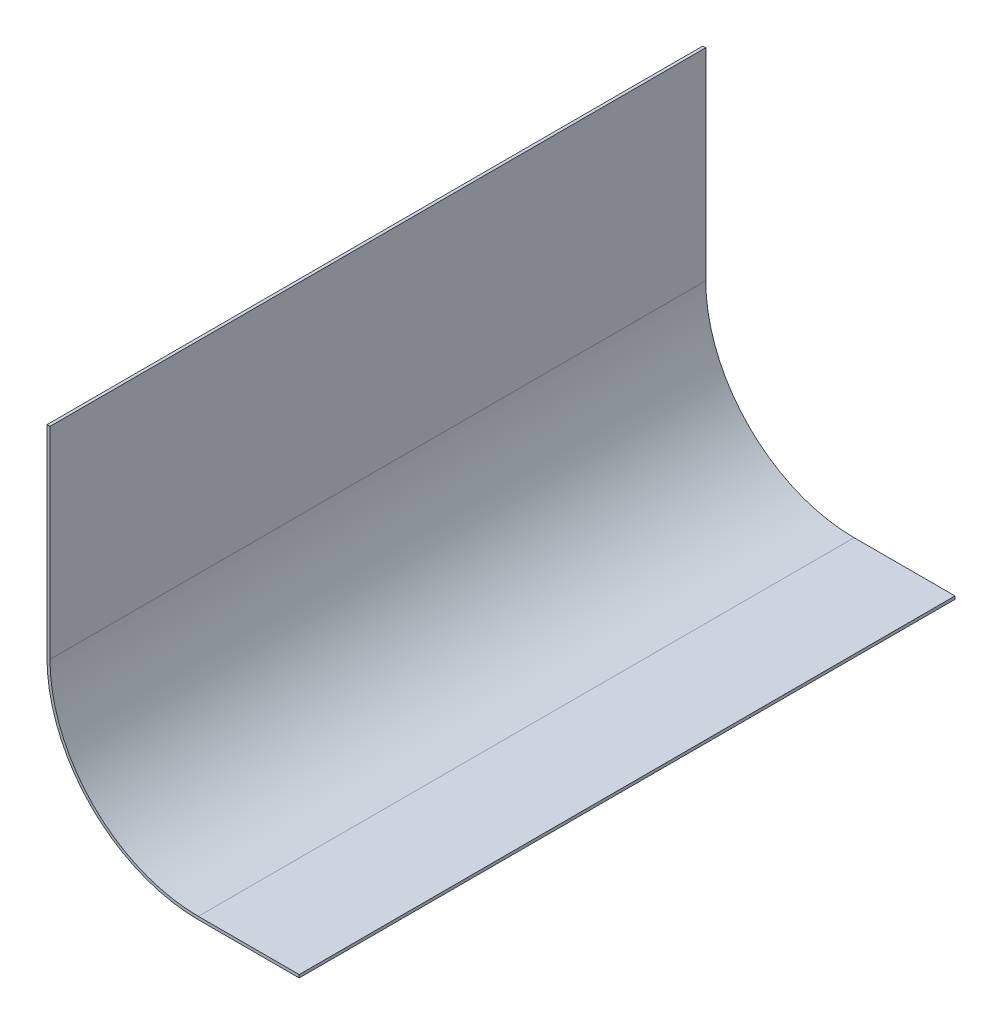
ISO-10303-21;
HEADER;
FILE_DESCRIPTION(('STEP AP214'),'2;1');
FILE_NAME('part.step','',(''),(''),'','','');
FILE_SCHEMA(('AUTOMOTIVE_DESIGN { 1 0 10303 214 1 1 1 1 }'));
ENDSEC;
DATA;
#1=APPLICATION_CONTEXT('core data for automotive mechanical design processes');
#2=APPLICATION_PROTOCOL_DEFINITION('international standard','automotive_design',2000,#1);
#3=PRODUCT_CONTEXT('',#1,'mechanical');
#4=PRODUCT('Part','Part','',(#3));
#5=PRODUCT_RELATED_PRODUCT_CATEGORY('part','',(#4));
#6=PRODUCT_DEFINITION_FORMATION('','',#4);
#7=PRODUCT_DEFINITION_CONTEXT('part definition',#1,'design');
#8=PRODUCT_DEFINITION('design','',#6,#7);
#9=PRODUCT_DEFINITION_SHAPE('','',#8);
#10=(LENGTH_UNIT() NAMED_UNIT(*) SI_UNIT(.MILLI.,.METRE.));
#11=(NAMED_UNIT(*) PLANE_ANGLE_UNIT() SI_UNIT($,.RADIAN.));
#12=(NAMED_UNIT(*) SI_UNIT($,.STERADIAN.) SOLID_ANGLE_UNIT());
#13=UNCERTAINTY_MEASURE_WITH_UNIT(LENGTH_MEASURE(1.E-05),#10,'distance_accuracy_value','');
#14=(GEOMETRIC_REPRESENTATION_CONTEXT(3) GLOBAL_UNCERTAINTY_ASSIGNED_CONTEXT((#13)) GLOBAL_UNIT_ASSIGNED_CONTEXT((#10,
#11,#12)) REPRESENTATION_CONTEXT('',''));
#15=CARTESIAN_POINT('',(0.,0.,0.));
#16=DIRECTION('',(0.,0.,1.));
#17=DIRECTION('',(1.,0.,0.));
#18=AXIS2_PLACEMENT_3D('',#15,#16,#17);
#19=CARTESIAN_POINT('',(-543.675,1066.8,165.1));
#20=DIRECTION('',(-1.,0.,0.));
#21=DIRECTION('',(0.,0.,1.));
#22=AXIS2_PLACEMENT_3D('',#19,#20,#21);
#23=PLANE('',#22);
#24=DIRECTION('',(0.,1.,0.));
#25=VECTOR('',#24,1.);
#26=CARTESIAN_POINT('',(-543.675,1066.8,-165.1));
#27=LINE('',#26,#25);
#28=CARTESIAN_POINT('',(-543.675,1066.8,-165.1));
#29=VERTEX_POINT('',#28);
#30=CARTESIAN_POINT('',(-543.675,1168.4,-165.1));
#31=VERTEX_POINT('',#30);
#32=EDGE_CURVE('E129',#29,#31,#27,.T.);
#33=ORIENTED_EDGE('',*,*,#32,.T.);
#34=DIRECTION('',(0.,0.,-1.));
#35=VECTOR('',#34,1.);
#36=CARTESIAN_POINT('',(-543.675,1168.4,165.1));
#37=LINE('',#36,#35);
#38=CARTESIAN_POINT('',(-543.675,1168.4,165.1));
#39=VERTEX_POINT('',#38);
#40=EDGE_CURVE('E11',#39,#31,#37,.T.);
#41=ORIENTED_EDGE('',*,*,#40,.F.);
#42=DIRECTION('',(0.,1.,0.));
#43=VECTOR('',#42,1.);
#44=CARTESIAN_POINT('',(-543.675,1066.8,165.1));
#45=LINE('',#44,#43);
#46=CARTESIAN_POINT('',(-543.675,1066.8,165.1));
#47=VERTEX_POINT('',#46);
#48=EDGE_CURVE('E87',#47,#39,#45,.T.);
#49=ORIENTED_EDGE('',*,*,#48,.F.);
#50=DIRECTION('',(0.,0.,-1.));
#51=VECTOR('',#50,1.);
#52=CARTESIAN_POINT('',(-543.675,1066.8,165.1));
#53=LINE('',#52,#51);
#54=EDGE_CURVE('E128',#47,#29,#53,.T.);
#55=ORIENTED_EDGE('',*,*,#54,.T.);
#56=EDGE_LOOP('',(#33,#41,#49,#55));
#57=FACE_BOUND('',#56,.T.);
#58=ADVANCED_FACE('F32',(#57),#23,.F.);
#59=CARTESIAN_POINT('',(-545.175,1168.4,165.1));
#60=DIRECTION('',(0.,1.,0.));
#61=DIRECTION('',(0.,0.,1.));
#62=AXIS2_PLACEMENT_3D('',#59,#60,#61);
#63=PLANE('',#62);
#64=DIRECTION('',(1.,0.,0.));
#65=VECTOR('',#64,1.);
#66=CARTESIAN_POINT('',(-545.175,1168.4,-165.1));
#67=LINE('',#66,#65);
#68=CARTESIAN_POINT('',(-545.175,1168.4,-165.1));
#69=VERTEX_POINT('',#68);
#70=EDGE_CURVE('E132',#69,#31,#67,.T.);
#71=ORIENTED_EDGE('',*,*,#70,.F.);
#72=DIRECTION('',(0.,0.,-1.));
#73=VECTOR('',#72,1.);
#74=CARTESIAN_POINT('',(-545.175,1168.4,165.1));
#75=LINE('',#74,#73);
#76=CARTESIAN_POINT('',(-545.175,1168.4,165.1));
#77=VERTEX_POINT('',#76);
#78=EDGE_CURVE('E40',#77,#69,#75,.T.);
#79=ORIENTED_EDGE('',*,*,#78,.F.);
#80=DIRECTION('',(1.,0.,0.));
#81=VECTOR('',#80,1.);
#82=CARTESIAN_POINT('',(-545.175,1168.4,165.1));
#83=LINE('',#82,#81);
#84=EDGE_CURVE('E171',#77,#39,#83,.T.);
#85=ORIENTED_EDGE('',*,*,#84,.T.);
#86=ORIENTED_EDGE('',*,*,#40,.T.);
#87=EDGE_LOOP('',(#71,#79,#85,#86));
#88=FACE_BOUND('',#87,.T.);
#89=ADVANCED_FACE('F162',(#88),#63,.T.);
#90=CARTESIAN_POINT('',(-545.175,1066.8,165.1));
#91=DIRECTION('',(-1.,0.,0.));
#92=DIRECTION('',(0.,0.,1.));
#93=AXIS2_PLACEMENT_3D('',#90,#91,#92);
#94=PLANE('',#93);
#95=DIRECTION('',(0.,1.,0.));
#96=VECTOR('',#95,1.);
#97=CARTESIAN_POINT('',(-545.175,1066.8,-165.1));
#98=LINE('',#97,#96);
#99=CARTESIAN_POINT('',(-545.175,1066.8,-165.1));
#100=VERTEX_POINT('',#99);
#101=EDGE_CURVE('E135',#100,#69,#98,.T.);
#102=ORIENTED_EDGE('',*,*,#101,.F.);
#103=DIRECTION('',(0.,0.,-1.));
#104=VECTOR('',#103,1.);
#105=CARTESIAN_POINT('',(-545.175,1066.8,165.1));
#106=LINE('',#105,#104);
#107=CARTESIAN_POINT('',(-545.175,1066.8,165.1));
#108=VERTEX_POINT('',#107);
#109=EDGE_CURVE('E152',#108,#100,#106,.T.);
#110=ORIENTED_EDGE('',*,*,#109,.F.);
#111=DIRECTION('',(0.,1.,0.));
#112=VECTOR('',#111,1.);
#113=CARTESIAN_POINT('',(-545.175,1066.8,165.1));
#114=LINE('',#113,#112);
#115=EDGE_CURVE('E159',#108,#77,#114,.T.);
#116=ORIENTED_EDGE('',*,*,#115,.T.);
#117=ORIENTED_EDGE('',*,*,#78,.T.);
#118=EDGE_LOOP('',(#102,#110,#116,#117));
#119=FACE_BOUND('',#118,.T.);
#120=ADVANCED_FACE('F157',(#119),#94,.T.);
#121=CARTESIAN_POINT('',(-468.975,1066.8,165.1));
#122=DIRECTION('',(0.,0.,-1.));
#123=DIRECTION('',(-1.,0.,0.));
#124=AXIS2_PLACEMENT_3D('',#121,#122,#123);
#125=CYLINDRICAL_SURFACE('',#124,76.2);
#126=CARTESIAN_POINT('',(-468.975,1066.8,-165.1));
#127=DIRECTION('',(0.,0.,-1.));
#128=DIRECTION('',(-1.,0.,0.));
#129=AXIS2_PLACEMENT_3D('',#126,#127,#128);
#130=CIRCLE('',#129,76.2);
#131=CARTESIAN_POINT('',(-468.975,990.6,-165.1));
#132=VERTEX_POINT('',#131);
#133=EDGE_CURVE('E138',#132,#100,#130,.T.);
#134=ORIENTED_EDGE('',*,*,#133,.F.);
#135=DIRECTION('',(0.,0.,-1.));
#136=VECTOR('',#135,1.);
#137=CARTESIAN_POINT('',(-468.975,990.6,165.1));
#138=LINE('',#137,#136);
#139=CARTESIAN_POINT('',(-468.975,990.6,165.1));
#140=VERTEX_POINT('',#139);
#141=EDGE_CURVE('E150',#140,#132,#138,.T.);
#142=ORIENTED_EDGE('',*,*,#141,.F.);
#143=CARTESIAN_POINT('',(-468.975,1066.8,165.1));
#144=DIRECTION('',(0.,0.,-1.));
#145=DIRECTION('',(-1.,0.,0.));
#146=AXIS2_PLACEMENT_3D('',#143,#144,#145);
#147=CIRCLE('',#146,76.2);
#148=EDGE_CURVE('E123',#140,#108,#147,.T.);
#149=ORIENTED_EDGE('',*,*,#148,.T.);
#150=ORIENTED_EDGE('',*,*,#109,.T.);
#151=EDGE_LOOP('',(#134,#142,#149,#150));
#152=FACE_BOUND('',#151,.T.);
#153=ADVANCED_FACE('F169',(#152),#125,.T.);
#154=CARTESIAN_POINT('',(-418.175,990.6,165.1));
#155=DIRECTION('',(0.,-1.,0.));
#156=DIRECTION('',(1.,0.,0.));
#157=AXIS2_PLACEMENT_3D('',#154,#155,#156);
#158=PLANE('',#157);
#159=DIRECTION('',(-1.,0.,0.));
#160=VECTOR('',#159,1.);
#161=CARTESIAN_POINT('',(-418.175,990.6,-165.1));
#162=LINE('',#161,#160);
#163=CARTESIAN_POINT('',(-418.175,990.6,-165.1));
#164=VERTEX_POINT('',#163);
#165=EDGE_CURVE('E141',#164,#132,#162,.T.);
#166=ORIENTED_EDGE('',*,*,#165,.F.);
#167=DIRECTION('',(0.,0.,-1.));
#168=VECTOR('',#167,1.);
#169=CARTESIAN_POINT('',(-418.175,990.6,165.1));
#170=LINE('',#169,#168);
#171=CARTESIAN_POINT('',(-418.175,990.6,165.1));
#172=VERTEX_POINT('',#171);
#173=EDGE_CURVE('E111',#172,#164,#170,.T.);
#174=ORIENTED_EDGE('',*,*,#173,.F.);
#175=DIRECTION('',(-1.,0.,0.));
#176=VECTOR('',#175,1.);
#177=CARTESIAN_POINT('',(-418.175,990.6,165.1));
#178=LINE('',#177,#176);
#179=EDGE_CURVE('E121',#172,#140,#178,.T.);
#180=ORIENTED_EDGE('',*,*,#179,.T.);
#181=ORIENTED_EDGE('',*,*,#141,.T.);
#182=EDGE_LOOP('',(#166,#174,#180,#181));
#183=FACE_BOUND('',#182,.T.);
#184=ADVANCED_FACE('F176',(#183),#158,.T.);
#185=CARTESIAN_POINT('',(-418.175,992.1,165.1));
#186=DIRECTION('',(1.,0.,0.));
#187=DIRECTION('',(0.,0.,-1.));
#188=AXIS2_PLACEMENT_3D('',#185,#186,#187);
#189=PLANE('',#188);
#190=DIRECTION('',(0.,-1.,0.));
#191=VECTOR('',#190,1.);
#192=CARTESIAN_POINT('',(-418.175,992.1,-165.1));
#193=LINE('',#192,#191);
#194=CARTESIAN_POINT('',(-418.175,992.1,-165.1));
#195=VERTEX_POINT('',#194);
#196=EDGE_CURVE('E110',#195,#164,#193,.T.);
#197=ORIENTED_EDGE('',*,*,#196,.F.);
#198=DIRECTION('',(0.,0.,-1.));
#199=VECTOR('',#198,1.);
#200=CARTESIAN_POINT('',(-418.175,992.1,165.1));
#201=LINE('',#200,#199);
#202=CARTESIAN_POINT('',(-418.175,992.1,165.1));
#203=VERTEX_POINT('',#202);
#204=EDGE_CURVE('E104',#203,#195,#201,.T.);
#205=ORIENTED_EDGE('',*,*,#204,.F.);
#206=DIRECTION('',(0.,-1.,0.));
#207=VECTOR('',#206,1.);
#208=CARTESIAN_POINT('',(-418.175,992.1,165.1));
#209=LINE('',#208,#207);
#210=EDGE_CURVE('E108',#203,#172,#209,.T.);
#211=ORIENTED_EDGE('',*,*,#210,.T.);
#212=ORIENTED_EDGE('',*,*,#173,.T.);
#213=EDGE_LOOP('',(#197,#205,#211,#212));
#214=FACE_BOUND('',#213,.T.);
#215=ADVANCED_FACE('F106',(#214),#189,.T.);
#216=CARTESIAN_POINT('',(-418.175,992.1,165.1));
#217=DIRECTION('',(0.,-1.,0.));
#218=DIRECTION('',(1.,0.,0.));
#219=AXIS2_PLACEMENT_3D('',#216,#217,#218);
#220=PLANE('',#219);
#221=DIRECTION('',(-1.,0.,0.));
#222=VECTOR('',#221,1.);
#223=CARTESIAN_POINT('',(-418.175,992.1,-165.1));
#224=LINE('',#223,#222);
#225=CARTESIAN_POINT('',(-468.975,992.1,-165.1));
#226=VERTEX_POINT('',#225);
#227=EDGE_CURVE('E75',#195,#226,#224,.T.);
#228=ORIENTED_EDGE('',*,*,#227,.T.);
#229=DIRECTION('',(0.,0.,-1.));
#230=VECTOR('',#229,1.);
#231=CARTESIAN_POINT('',(-468.975,992.1,165.1));
#232=LINE('',#231,#230);
#233=CARTESIAN_POINT('',(-468.975,992.1,165.1));
#234=VERTEX_POINT('',#233);
#235=EDGE_CURVE('E112',#234,#226,#232,.T.);
#236=ORIENTED_EDGE('',*,*,#235,.F.);
#237=DIRECTION('',(-1.,0.,0.));
#238=VECTOR('',#237,1.);
#239=CARTESIAN_POINT('',(-418.175,992.1,165.1));
#240=LINE('',#239,#238);
#241=EDGE_CURVE('E114',#203,#234,#240,.T.);
#242=ORIENTED_EDGE('',*,*,#241,.F.);
#243=ORIENTED_EDGE('',*,*,#204,.T.);
#244=EDGE_LOOP('',(#228,#236,#242,#243));
#245=FACE_BOUND('',#244,.T.);
#246=ADVANCED_FACE('F115',(#245),#220,.F.);
#247=CARTESIAN_POINT('',(-468.975,1066.8,165.1));
#248=DIRECTION('',(0.,0.,-1.));
#249=DIRECTION('',(-1.,0.,0.));
#250=AXIS2_PLACEMENT_3D('',#247,#248,#249);
#251=CYLINDRICAL_SURFACE('',#250,74.7);
#252=CARTESIAN_POINT('',(-468.975,1066.8,-165.1));
#253=DIRECTION('',(0.,0.,1.));
#254=DIRECTION('',(1.,0.,0.));
#255=AXIS2_PLACEMENT_3D('',#252,#253,#254);
#256=CIRCLE('',#255,74.7);
#257=EDGE_CURVE('E81',#226,#29,#256,.F.);
#258=ORIENTED_EDGE('',*,*,#257,.T.);
#259=ORIENTED_EDGE('',*,*,#54,.F.);
#260=CARTESIAN_POINT('',(-468.975,1066.8,165.1));
#261=DIRECTION('',(0.,0.,1.));
#262=DIRECTION('',(1.,0.,0.));
#263=AXIS2_PLACEMENT_3D('',#260,#261,#262);
#264=CIRCLE('',#263,74.7);
#265=EDGE_CURVE('E48',#234,#47,#264,.F.);
#266=ORIENTED_EDGE('',*,*,#265,.F.);
#267=ORIENTED_EDGE('',*,*,#235,.T.);
#268=EDGE_LOOP('',(#258,#259,#266,#267));
#269=FACE_BOUND('',#268,.T.);
#270=ADVANCED_FACE('F178',(#269),#251,.F.);
#271=CARTESIAN_POINT('',(-468.975,1066.8,165.1));
#272=DIRECTION('',(0.,0.,-1.));
#273=DIRECTION('',(-1.,0.,0.));
#274=AXIS2_PLACEMENT_3D('',#271,#272,#273);
#275=PLANE('',#274);
#276=ORIENTED_EDGE('',*,*,#48,.T.);
#277=ORIENTED_EDGE('',*,*,#84,.F.);
#278=ORIENTED_EDGE('',*,*,#115,.F.);
#279=ORIENTED_EDGE('',*,*,#148,.F.);
#280=ORIENTED_EDGE('',*,*,#179,.F.);
#281=ORIENTED_EDGE('',*,*,#210,.F.);
#282=ORIENTED_EDGE('',*,*,#241,.T.);
#283=ORIENTED_EDGE('',*,*,#265,.T.);
#284=EDGE_LOOP('',(#276,#277,#278,#279,#280,#281,#282,#283));
#285=FACE_BOUND('',#284,.T.);
#286=ADVANCED_FACE('F118',(#285),#275,.F.);
#287=CARTESIAN_POINT('',(-468.975,1066.8,-165.1));
#288=DIRECTION('',(0.,0.,-1.));
#289=DIRECTION('',(-1.,0.,0.));
#290=AXIS2_PLACEMENT_3D('',#287,#288,#289);
#291=PLANE('',#290);
#292=ORIENTED_EDGE('',*,*,#32,.F.);
#293=ORIENTED_EDGE('',*,*,#257,.F.);
#294=ORIENTED_EDGE('',*,*,#227,.F.);
#295=ORIENTED_EDGE('',*,*,#196,.T.);
#296=ORIENTED_EDGE('',*,*,#165,.T.);
#297=ORIENTED_EDGE('',*,*,#133,.T.);
#298=ORIENTED_EDGE('',*,*,#101,.T.);
#299=ORIENTED_EDGE('',*,*,#70,.T.);
#300=EDGE_LOOP('',(#292,#293,#294,#295,#296,#297,#298,#299));
#301=FACE_BOUND('',#300,.T.);
#302=ADVANCED_FACE('F165',(#301),#291,.T.);
#303=CLOSED_SHELL('',(#58,#89,#120,#153,#184,#215,#246,#270,#286,#302));
#304=MANIFOLD_SOLID_BREP('B2',#303);
#305=ADVANCED_BREP_SHAPE_REPRESENTATION('',(#18,#304),#14);
#306=SHAPE_DEFINITION_REPRESENTATION(#9,#305);
ENDSEC;
END-ISO-10303-21;
